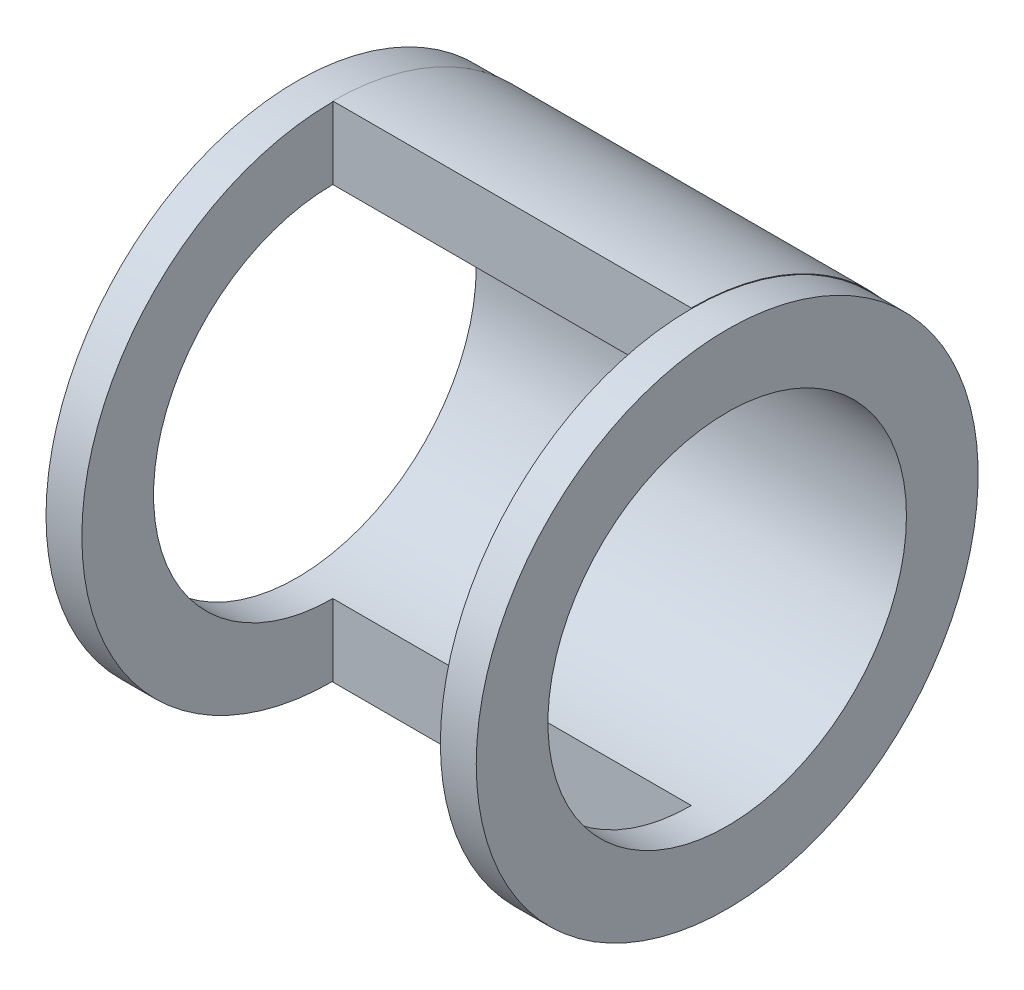
ISO-10303-21;
HEADER;
FILE_DESCRIPTION(('STEP AP214'),'2;1');
FILE_NAME('part.step','',(''),(''),'','','');
FILE_SCHEMA(('AUTOMOTIVE_DESIGN { 1 0 10303 214 1 1 1 1 }'));
ENDSEC;
DATA;
#1=APPLICATION_CONTEXT('core data for automotive mechanical design processes');
#2=APPLICATION_PROTOCOL_DEFINITION('international standard','automotive_design',2000,#1);
#3=PRODUCT_CONTEXT('',#1,'mechanical');
#4=PRODUCT('Part','Part','',(#3));
#5=PRODUCT_RELATED_PRODUCT_CATEGORY('part','',(#4));
#6=PRODUCT_DEFINITION_FORMATION('','',#4);
#7=PRODUCT_DEFINITION_CONTEXT('part definition',#1,'design');
#8=PRODUCT_DEFINITION('design','',#6,#7);
#9=PRODUCT_DEFINITION_SHAPE('','',#8);
#10=(LENGTH_UNIT() NAMED_UNIT(*) SI_UNIT(.MILLI.,.METRE.));
#11=(NAMED_UNIT(*) PLANE_ANGLE_UNIT() SI_UNIT($,.RADIAN.));
#12=(NAMED_UNIT(*) SI_UNIT($,.STERADIAN.) SOLID_ANGLE_UNIT());
#13=UNCERTAINTY_MEASURE_WITH_UNIT(LENGTH_MEASURE(1.E-05),#10,'distance_accuracy_value','');
#14=(GEOMETRIC_REPRESENTATION_CONTEXT(3) GLOBAL_UNCERTAINTY_ASSIGNED_CONTEXT((#13)) GLOBAL_UNIT_ASSIGNED_CONTEXT((#10,
#11,#12)) REPRESENTATION_CONTEXT('',''));
#15=CARTESIAN_POINT('',(0.,0.,0.));
#16=DIRECTION('',(0.,0.,1.));
#17=DIRECTION('',(1.,0.,0.));
#18=AXIS2_PLACEMENT_3D('',#15,#16,#17);
#19=CARTESIAN_POINT('',(0.,0.,0.));
#20=DIRECTION('',(0.,0.,-1.));
#21=DIRECTION('',(1.,0.,0.));
#22=AXIS2_PLACEMENT_3D('',#19,#20,#21);
#23=PLANE('',#22);
#24=DIRECTION('',(-1.,0.,0.));
#25=VECTOR('',#24,1.);
#26=CARTESIAN_POINT('',(70.,-50.,3.49148133884313E-13));
#27=LINE('',#26,#25);
#28=CARTESIAN_POINT('',(-40.,-50.,3.49148133884313E-13));
#29=VERTEX_POINT('',#28);
#30=CARTESIAN_POINT('',(60.,-50.,3.49148133884313E-13));
#31=VERTEX_POINT('',#30);
#32=EDGE_CURVE('E48',#29,#31,#27,.F.);
#33=ORIENTED_EDGE('',*,*,#32,.F.);
#34=DIRECTION('',(0.,1.,0.));
#35=VECTOR('',#34,1.);
#36=CARTESIAN_POINT('',(-40.,0.,0.));
#37=LINE('',#36,#35);
#38=CARTESIAN_POINT('',(-40.,-70.,4.88807387438039E-13));
#39=VERTEX_POINT('',#38);
#40=EDGE_CURVE('E41',#39,#29,#37,.T.);
#41=ORIENTED_EDGE('',*,*,#40,.F.);
#42=CARTESIAN_POINT('',(-40.,-70.1820889460502,4.90078907752326E-13));
#43=VERTEX_POINT('',#42);
#44=EDGE_CURVE('E154',#43,#39,#37,.T.);
#45=ORIENTED_EDGE('',*,*,#44,.F.);
#46=DIRECTION('',(-1.,0.,0.));
#47=VECTOR('',#46,1.);
#48=CARTESIAN_POINT('',(60.,-70.1820889460502,4.90078907752326E-13));
#49=LINE('',#48,#47);
#50=CARTESIAN_POINT('',(60.,-70.1820889460502,4.90078907752326E-13));
#51=VERTEX_POINT('',#50);
#52=EDGE_CURVE('E103',#51,#43,#49,.T.);
#53=ORIENTED_EDGE('',*,*,#52,.F.);
#54=DIRECTION('',(0.,-1.,0.));
#55=VECTOR('',#54,1.);
#56=CARTESIAN_POINT('',(60.,0.,0.));
#57=LINE('',#56,#55);
#58=CARTESIAN_POINT('',(60.,-70.,4.88807387438039E-13));
#59=VERTEX_POINT('',#58);
#60=EDGE_CURVE('E102',#59,#51,#57,.T.);
#61=ORIENTED_EDGE('',*,*,#60,.F.);
#62=EDGE_CURVE('E54',#31,#59,#57,.T.);
#63=ORIENTED_EDGE('',*,*,#62,.F.);
#64=EDGE_LOOP('',(#33,#41,#45,#53,#61,#63));
#65=FACE_BOUND('',#64,.T.);
#66=ADVANCED_FACE('F33',(#65),#23,.F.);
#67=DIRECTION('',(-1.,0.,0.));
#68=VECTOR('',#67,1.);
#69=CARTESIAN_POINT('',(70.,50.,-3.49148133884313E-13));
#70=LINE('',#69,#68);
#71=CARTESIAN_POINT('',(60.,50.,-3.49148133884313E-13));
#72=VERTEX_POINT('',#71);
#73=CARTESIAN_POINT('',(-40.,50.,-3.49148133884313E-13));
#74=VERTEX_POINT('',#73);
#75=EDGE_CURVE('E84',#72,#74,#70,.T.);
#76=ORIENTED_EDGE('',*,*,#75,.F.);
#77=CARTESIAN_POINT('',(60.,70.,-4.88807387438039E-13));
#78=VERTEX_POINT('',#77);
#79=EDGE_CURVE('E91',#78,#72,#57,.T.);
#80=ORIENTED_EDGE('',*,*,#79,.F.);
#81=CARTESIAN_POINT('',(60.,70.1820889460502,0.));
#82=VERTEX_POINT('',#81);
#83=EDGE_CURVE('E100',#82,#78,#57,.T.);
#84=ORIENTED_EDGE('',*,*,#83,.F.);
#85=DIRECTION('',(-1.,0.,0.));
#86=VECTOR('',#85,1.);
#87=CARTESIAN_POINT('',(60.,70.1820889460502,0.));
#88=LINE('',#87,#86);
#89=CARTESIAN_POINT('',(-40.,70.1820889460502,0.));
#90=VERTEX_POINT('',#89);
#91=EDGE_CURVE('E106',#82,#90,#88,.T.);
#92=ORIENTED_EDGE('',*,*,#91,.T.);
#93=CARTESIAN_POINT('',(-40.,70.,-4.88807387438039E-13));
#94=VERTEX_POINT('',#93);
#95=EDGE_CURVE('E157',#94,#90,#37,.T.);
#96=ORIENTED_EDGE('',*,*,#95,.F.);
#97=EDGE_CURVE('E94',#74,#94,#37,.T.);
#98=ORIENTED_EDGE('',*,*,#97,.F.);
#99=EDGE_LOOP('',(#76,#80,#84,#92,#96,#98));
#100=FACE_BOUND('',#99,.T.);
#101=ADVANCED_FACE('F90',(#100),#23,.F.);
#102=CARTESIAN_POINT('',(-40.,0.,0.));
#103=DIRECTION('',(-1.,0.,0.));
#104=DIRECTION('',(0.,0.,1.));
#105=AXIS2_PLACEMENT_3D('',#102,#103,#104);
#106=PLANE('',#105);
#107=CARTESIAN_POINT('',(-40.,0.,0.));
#108=DIRECTION('',(-1.,0.,0.));
#109=DIRECTION('',(0.,0.,1.));
#110=AXIS2_PLACEMENT_3D('',#107,#108,#109);
#111=CIRCLE('',#110,50.);
#112=EDGE_CURVE('E120',#74,#29,#111,.F.);
#113=ORIENTED_EDGE('',*,*,#112,.F.);
#114=ORIENTED_EDGE('',*,*,#97,.T.);
#115=CARTESIAN_POINT('',(-40.,0.,0.));
#116=DIRECTION('',(-1.,0.,0.));
#117=DIRECTION('',(0.,0.,1.));
#118=AXIS2_PLACEMENT_3D('',#115,#116,#117);
#119=CIRCLE('',#118,70.);
#120=EDGE_CURVE('E164',#39,#94,#119,.T.);
#121=ORIENTED_EDGE('',*,*,#120,.F.);
#122=ORIENTED_EDGE('',*,*,#40,.T.);
#123=EDGE_LOOP('',(#113,#114,#121,#122));
#124=FACE_BOUND('',#123,.T.);
#125=ADVANCED_FACE('F35',(#124),#106,.F.);
#126=CARTESIAN_POINT('',(-50.,0.,0.));
#127=DIRECTION('',(-1.,0.,0.));
#128=DIRECTION('',(0.,0.,1.));
#129=AXIS2_PLACEMENT_3D('',#126,#127,#128);
#130=PLANE('',#129);
#131=CARTESIAN_POINT('',(-50.,0.,0.));
#132=DIRECTION('',(1.,0.,0.));
#133=DIRECTION('',(0.,0.,-1.));
#134=AXIS2_PLACEMENT_3D('',#131,#132,#133);
#135=CIRCLE('',#134,50.);
#136=CARTESIAN_POINT('',(-50.,0.,-50.));
#137=VERTEX_POINT('',#136);
#138=EDGE_CURVE('E125',#137,#137,#135,.T.);
#139=ORIENTED_EDGE('',*,*,#138,.T.);
#140=EDGE_LOOP('',(#139));
#141=FACE_BOUND('',#140,.T.);
#142=CARTESIAN_POINT('',(-50.,0.,0.));
#143=DIRECTION('',(-1.,0.,0.));
#144=DIRECTION('',(0.,0.,1.));
#145=AXIS2_PLACEMENT_3D('',#142,#143,#144);
#146=CIRCLE('',#145,70.);
#147=CARTESIAN_POINT('',(-50.,0.,70.));
#148=VERTEX_POINT('',#147);
#149=EDGE_CURVE('E167',#148,#148,#146,.T.);
#150=ORIENTED_EDGE('',*,*,#149,.T.);
#151=EDGE_LOOP('',(#150));
#152=FACE_BOUND('',#151,.T.);
#153=ADVANCED_FACE('F129',(#141,#152),#130,.T.);
#154=CARTESIAN_POINT('',(-50.,0.,0.));
#155=DIRECTION('',(-1.,0.,0.));
#156=DIRECTION('',(0.,0.,1.));
#157=AXIS2_PLACEMENT_3D('',#154,#155,#156);
#158=CYLINDRICAL_SURFACE('',#157,70.);
#159=EDGE_CURVE('E165',#94,#39,#119,.T.);
#160=ORIENTED_EDGE('',*,*,#159,.T.);
#161=ORIENTED_EDGE('',*,*,#120,.T.);
#162=EDGE_LOOP('',(#160,#161));
#163=FACE_BOUND('',#162,.T.);
#164=ORIENTED_EDGE('',*,*,#149,.F.);
#165=EDGE_LOOP('',(#164));
#166=FACE_BOUND('',#165,.T.);
#167=ADVANCED_FACE('F192',(#163,#166),#158,.T.);
#168=CARTESIAN_POINT('',(-40.,0.,0.));
#169=DIRECTION('',(-1.,0.,0.));
#170=DIRECTION('',(0.,-1.,0.));
#171=AXIS2_PLACEMENT_3D('',#168,#169,#170);
#172=PLANE('',#171);
#173=ORIENTED_EDGE('',*,*,#159,.F.);
#174=ORIENTED_EDGE('',*,*,#95,.T.);
#175=CARTESIAN_POINT('',(-40.,0.,0.));
#176=DIRECTION('',(1.,0.,0.));
#177=DIRECTION('',(0.,1.,0.));
#178=AXIS2_PLACEMENT_3D('',#175,#176,#177);
#179=CIRCLE('',#178,70.1820889460502);
#180=EDGE_CURVE('E160',#43,#90,#179,.T.);
#181=ORIENTED_EDGE('',*,*,#180,.F.);
#182=ORIENTED_EDGE('',*,*,#44,.T.);
#183=EDGE_LOOP('',(#173,#174,#181,#182));
#184=FACE_BOUND('',#183,.T.);
#185=ADVANCED_FACE('F176',(#184),#172,.T.);
#186=CARTESIAN_POINT('',(60.,0.,0.));
#187=DIRECTION('',(1.,0.,0.));
#188=DIRECTION('',(0.,1.,0.));
#189=AXIS2_PLACEMENT_3D('',#186,#187,#188);
#190=PLANE('',#189);
#191=ORIENTED_EDGE('',*,*,#83,.T.);
#192=CARTESIAN_POINT('',(60.,0.,0.));
#193=DIRECTION('',(-1.,0.,0.));
#194=DIRECTION('',(0.,0.,1.));
#195=AXIS2_PLACEMENT_3D('',#192,#193,#194);
#196=CIRCLE('',#195,70.);
#197=EDGE_CURVE('E113',#78,#59,#196,.T.);
#198=ORIENTED_EDGE('',*,*,#197,.T.);
#199=ORIENTED_EDGE('',*,*,#60,.T.);
#200=CARTESIAN_POINT('',(60.,0.,0.));
#201=DIRECTION('',(1.,0.,0.));
#202=DIRECTION('',(0.,1.,0.));
#203=AXIS2_PLACEMENT_3D('',#200,#201,#202);
#204=CIRCLE('',#203,70.1820889460502);
#205=EDGE_CURVE('E162',#51,#82,#204,.T.);
#206=ORIENTED_EDGE('',*,*,#205,.T.);
#207=EDGE_LOOP('',(#191,#198,#199,#206));
#208=FACE_BOUND('',#207,.T.);
#209=ADVANCED_FACE('F148',(#208),#190,.T.);
#210=CARTESIAN_POINT('',(60.,0.,0.));
#211=DIRECTION('',(1.,0.,0.));
#212=DIRECTION('',(0.,1.,0.));
#213=AXIS2_PLACEMENT_3D('',#210,#211,#212);
#214=CYLINDRICAL_SURFACE('',#213,70.1820889460502);
#215=ORIENTED_EDGE('',*,*,#180,.T.);
#216=ORIENTED_EDGE('',*,*,#91,.F.);
#217=ORIENTED_EDGE('',*,*,#205,.F.);
#218=ORIENTED_EDGE('',*,*,#52,.T.);
#219=EDGE_LOOP('',(#215,#216,#217,#218));
#220=FACE_BOUND('',#219,.T.);
#221=ADVANCED_FACE('F141',(#220),#214,.T.);
#222=CARTESIAN_POINT('',(70.,0.,0.));
#223=DIRECTION('',(-1.,0.,0.));
#224=DIRECTION('',(0.,0.,1.));
#225=AXIS2_PLACEMENT_3D('',#222,#223,#224);
#226=PLANE('',#225);
#227=CARTESIAN_POINT('',(70.,0.,0.));
#228=DIRECTION('',(1.,0.,0.));
#229=DIRECTION('',(0.,0.,-1.));
#230=AXIS2_PLACEMENT_3D('',#227,#228,#229);
#231=CIRCLE('',#230,50.);
#232=CARTESIAN_POINT('',(70.,0.,-50.));
#233=VERTEX_POINT('',#232);
#234=EDGE_CURVE('E95',#233,#233,#231,.T.);
#235=ORIENTED_EDGE('',*,*,#234,.F.);
#236=EDGE_LOOP('',(#235));
#237=FACE_BOUND('',#236,.T.);
#238=CARTESIAN_POINT('',(70.,0.,0.));
#239=DIRECTION('',(-1.,0.,0.));
#240=DIRECTION('',(0.,0.,1.));
#241=AXIS2_PLACEMENT_3D('',#238,#239,#240);
#242=CIRCLE('',#241,70.);
#243=CARTESIAN_POINT('',(70.,0.,70.));
#244=VERTEX_POINT('',#243);
#245=EDGE_CURVE('E117',#244,#244,#242,.T.);
#246=ORIENTED_EDGE('',*,*,#245,.F.);
#247=EDGE_LOOP('',(#246));
#248=FACE_BOUND('',#247,.T.);
#249=ADVANCED_FACE('F138',(#237,#248),#226,.F.);
#250=CARTESIAN_POINT('',(60.,0.,0.));
#251=DIRECTION('',(-1.,0.,0.));
#252=DIRECTION('',(0.,0.,1.));
#253=AXIS2_PLACEMENT_3D('',#250,#251,#252);
#254=PLANE('',#253);
#255=ORIENTED_EDGE('',*,*,#79,.T.);
#256=CARTESIAN_POINT('',(60.,0.,0.));
#257=DIRECTION('',(-1.,0.,0.));
#258=DIRECTION('',(0.,0.,1.));
#259=AXIS2_PLACEMENT_3D('',#256,#257,#258);
#260=CIRCLE('',#259,50.);
#261=EDGE_CURVE('E11',#72,#31,#260,.F.);
#262=ORIENTED_EDGE('',*,*,#261,.T.);
#263=ORIENTED_EDGE('',*,*,#62,.T.);
#264=EDGE_CURVE('E98',#59,#78,#196,.T.);
#265=ORIENTED_EDGE('',*,*,#264,.T.);
#266=EDGE_LOOP('',(#255,#262,#263,#265));
#267=FACE_BOUND('',#266,.T.);
#268=ADVANCED_FACE('F97',(#267),#254,.T.);
#269=CARTESIAN_POINT('',(-50.,0.,0.));
#270=DIRECTION('',(-1.,0.,0.));
#271=DIRECTION('',(0.,0.,1.));
#272=AXIS2_PLACEMENT_3D('',#269,#270,#271);
#273=CYLINDRICAL_SURFACE('',#272,70.);
#274=ORIENTED_EDGE('',*,*,#245,.T.);
#275=EDGE_LOOP('',(#274));
#276=FACE_BOUND('',#275,.T.);
#277=ORIENTED_EDGE('',*,*,#197,.F.);
#278=ORIENTED_EDGE('',*,*,#264,.F.);
#279=EDGE_LOOP('',(#277,#278));
#280=FACE_BOUND('',#279,.T.);
#281=ADVANCED_FACE('F134',(#276,#280),#273,.T.);
#282=CARTESIAN_POINT('',(70.,0.,0.));
#283=DIRECTION('',(-1.,0.,0.));
#284=DIRECTION('',(0.,0.,1.));
#285=AXIS2_PLACEMENT_3D('',#282,#283,#284);
#286=CYLINDRICAL_SURFACE('',#285,50.);
#287=ORIENTED_EDGE('',*,*,#138,.F.);
#288=EDGE_LOOP('',(#287));
#289=FACE_BOUND('',#288,.T.);
#290=ORIENTED_EDGE('',*,*,#234,.T.);
#291=EDGE_LOOP('',(#290));
#292=FACE_BOUND('',#291,.T.);
#293=ORIENTED_EDGE('',*,*,#112,.T.);
#294=ORIENTED_EDGE('',*,*,#32,.T.);
#295=ORIENTED_EDGE('',*,*,#261,.F.);
#296=ORIENTED_EDGE('',*,*,#75,.T.);
#297=EDGE_LOOP('',(#293,#294,#295,#296));
#298=FACE_BOUND('',#297,.T.);
#299=ADVANCED_FACE('F83',(#289,#292,#298),#286,.F.);
#300=CLOSED_SHELL('',(#66,#101,#125,#153,#167,#185,#209,#221,#249,#268,#281,#299));
#301=MANIFOLD_SOLID_BREP('B2',#300);
#302=ADVANCED_BREP_SHAPE_REPRESENTATION('',(#18,#301),#14);
#303=SHAPE_DEFINITION_REPRESENTATION(#9,#302);
ENDSEC;
END-ISO-10303-21;
